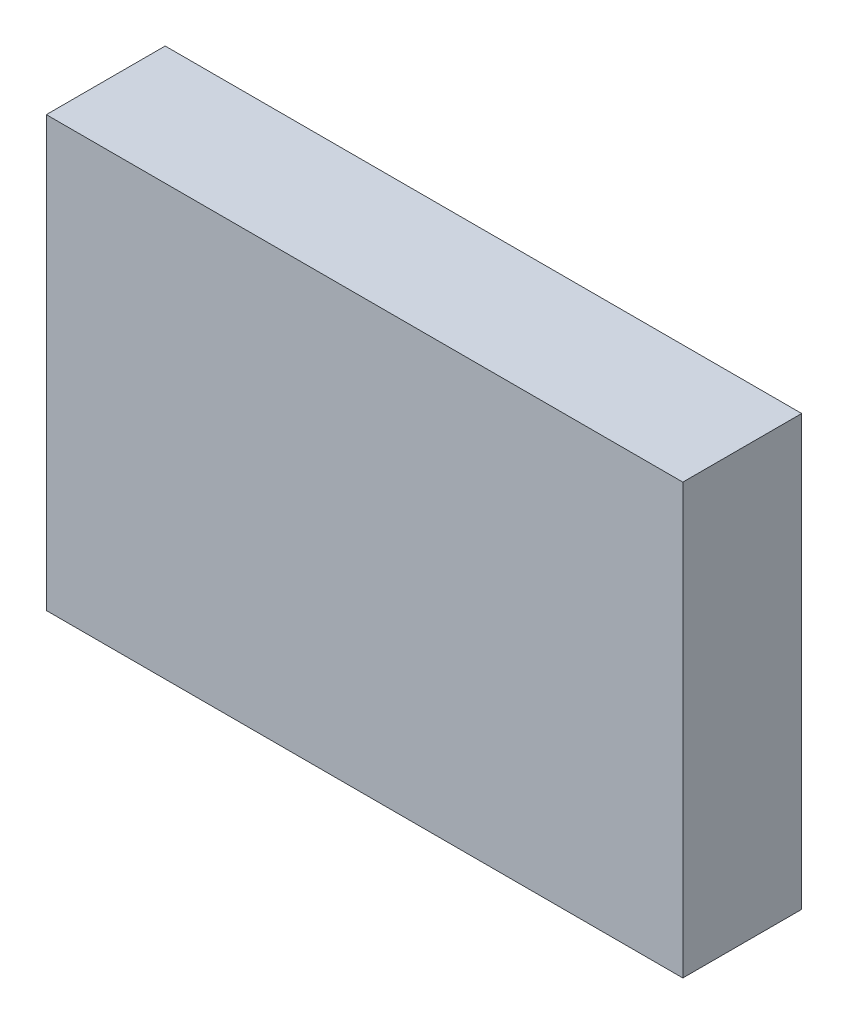
ISO-10303-21;
HEADER;
FILE_DESCRIPTION(('STEP AP214'),'2;1');
FILE_NAME('part.step','',(''),(''),'','','');
FILE_SCHEMA(('AUTOMOTIVE_DESIGN { 1 0 10303 214 1 1 1 1 }'));
ENDSEC;
DATA;
#1=APPLICATION_CONTEXT('core data for automotive mechanical design processes');
#2=APPLICATION_PROTOCOL_DEFINITION('international standard','automotive_design',2000,#1);
#3=PRODUCT_CONTEXT('',#1,'mechanical');
#4=PRODUCT('Part','Part','',(#3));
#5=PRODUCT_RELATED_PRODUCT_CATEGORY('part','',(#4));
#6=PRODUCT_DEFINITION_FORMATION('','',#4);
#7=PRODUCT_DEFINITION_CONTEXT('part definition',#1,'design');
#8=PRODUCT_DEFINITION('design','',#6,#7);
#9=PRODUCT_DEFINITION_SHAPE('','',#8);
#10=(LENGTH_UNIT() NAMED_UNIT(*) SI_UNIT(.MILLI.,.METRE.));
#11=(NAMED_UNIT(*) PLANE_ANGLE_UNIT() SI_UNIT($,.RADIAN.));
#12=(NAMED_UNIT(*) SI_UNIT($,.STERADIAN.) SOLID_ANGLE_UNIT());
#13=UNCERTAINTY_MEASURE_WITH_UNIT(LENGTH_MEASURE(1.E-05),#10,'distance_accuracy_value','');
#14=(GEOMETRIC_REPRESENTATION_CONTEXT(3) GLOBAL_UNCERTAINTY_ASSIGNED_CONTEXT((#13)) GLOBAL_UNIT_ASSIGNED_CONTEXT((#10,
#11,#12)) REPRESENTATION_CONTEXT('',''));
#15=CARTESIAN_POINT('',(0.,0.,0.));
#16=DIRECTION('',(0.,0.,1.));
#17=DIRECTION('',(1.,0.,0.));
#18=AXIS2_PLACEMENT_3D('',#15,#16,#17);
#19=CARTESIAN_POINT('',(4.15000186,2.79999948,1.54999944));
#20=DIRECTION('',(0.,0.,-1.));
#21=DIRECTION('',(-1.,0.,0.));
#22=AXIS2_PLACEMENT_3D('',#19,#20,#21);
#23=PLANE('',#22);
#24=DIRECTION('',(0.,1.,0.));
#25=VECTOR('',#24,1.);
#26=CARTESIAN_POINT('',(-4.14999932,2.79999948,1.54999944));
#27=LINE('',#26,#25);
#28=CARTESIAN_POINT('',(-4.14999932,2.79999948,1.54999944));
#29=VERTEX_POINT('',#28);
#30=CARTESIAN_POINT('',(-4.14999932,-2.79999948,1.54999944));
#31=VERTEX_POINT('',#30);
#32=EDGE_CURVE('E55',#29,#31,#27,.F.);
#33=ORIENTED_EDGE('',*,*,#32,.T.);
#34=DIRECTION('',(1.,0.,0.));
#35=VECTOR('',#34,1.);
#36=CARTESIAN_POINT('',(-4.14999932,-2.79999948,1.54999944));
#37=LINE('',#36,#35);
#38=CARTESIAN_POINT('',(4.15000186,-2.79999948,1.54999944));
#39=VERTEX_POINT('',#38);
#40=EDGE_CURVE('E57',#31,#39,#37,.T.);
#41=ORIENTED_EDGE('',*,*,#40,.T.);
#42=DIRECTION('',(0.,1.,0.));
#43=VECTOR('',#42,1.);
#44=CARTESIAN_POINT('',(4.15000186,-2.79999948,1.54999944));
#45=LINE('',#44,#43);
#46=CARTESIAN_POINT('',(4.15000186,2.79999948,1.54999944));
#47=VERTEX_POINT('',#46);
#48=EDGE_CURVE('E20',#39,#47,#45,.T.);
#49=ORIENTED_EDGE('',*,*,#48,.T.);
#50=DIRECTION('',(1.,0.,0.));
#51=VECTOR('',#50,1.);
#52=CARTESIAN_POINT('',(4.15000186,2.79999948,1.54999944));
#53=LINE('',#52,#51);
#54=EDGE_CURVE('E80',#47,#29,#53,.F.);
#55=ORIENTED_EDGE('',*,*,#54,.T.);
#56=EDGE_LOOP('',(#33,#41,#49,#55));
#57=FACE_BOUND('',#56,.T.);
#58=ADVANCED_FACE('F17',(#57),#23,.F.);
#59=CARTESIAN_POINT('',(4.15000186,-2.79999948,0.));
#60=DIRECTION('',(-1.,0.,0.));
#61=DIRECTION('',(0.,0.,1.));
#62=AXIS2_PLACEMENT_3D('',#59,#60,#61);
#63=PLANE('',#62);
#64=DIRECTION('',(0.,0.,-1.));
#65=VECTOR('',#64,1.);
#66=CARTESIAN_POINT('',(4.15000186,2.79999948,0.));
#67=LINE('',#66,#65);
#68=CARTESIAN_POINT('',(4.15000186,2.79999948,0.));
#69=VERTEX_POINT('',#68);
#70=EDGE_CURVE('E68',#69,#47,#67,.F.);
#71=ORIENTED_EDGE('',*,*,#70,.T.);
#72=ORIENTED_EDGE('',*,*,#48,.F.);
#73=DIRECTION('',(0.,0.,1.));
#74=VECTOR('',#73,1.);
#75=CARTESIAN_POINT('',(4.15000186,-2.79999948,0.));
#76=LINE('',#75,#74);
#77=CARTESIAN_POINT('',(4.15000186,-2.79999948,0.));
#78=VERTEX_POINT('',#77);
#79=EDGE_CURVE('E63',#39,#78,#76,.F.);
#80=ORIENTED_EDGE('',*,*,#79,.T.);
#81=DIRECTION('',(0.,1.,0.));
#82=VECTOR('',#81,1.);
#83=CARTESIAN_POINT('',(4.15000186,2.79999948,0.));
#84=LINE('',#83,#82);
#85=EDGE_CURVE('E83',#69,#78,#84,.F.);
#86=ORIENTED_EDGE('',*,*,#85,.F.);
#87=EDGE_LOOP('',(#71,#72,#80,#86));
#88=FACE_BOUND('',#87,.T.);
#89=ADVANCED_FACE('F65',(#88),#63,.F.);
#90=CARTESIAN_POINT('',(-4.14999932,-2.79999948,0.));
#91=DIRECTION('',(0.,1.,0.));
#92=DIRECTION('',(0.,0.,1.));
#93=AXIS2_PLACEMENT_3D('',#90,#91,#92);
#94=PLANE('',#93);
#95=ORIENTED_EDGE('',*,*,#79,.F.);
#96=ORIENTED_EDGE('',*,*,#40,.F.);
#97=DIRECTION('',(0.,0.,-1.));
#98=VECTOR('',#97,1.);
#99=CARTESIAN_POINT('',(-4.14999932,-2.79999948,0.));
#100=LINE('',#99,#98);
#101=CARTESIAN_POINT('',(-4.14999932,-2.79999948,0.));
#102=VERTEX_POINT('',#101);
#103=EDGE_CURVE('E75',#31,#102,#100,.T.);
#104=ORIENTED_EDGE('',*,*,#103,.T.);
#105=DIRECTION('',(-1.,0.,0.));
#106=VECTOR('',#105,1.);
#107=CARTESIAN_POINT('',(4.15000186,-2.79999948,0.));
#108=LINE('',#107,#106);
#109=EDGE_CURVE('E72',#78,#102,#108,.T.);
#110=ORIENTED_EDGE('',*,*,#109,.F.);
#111=EDGE_LOOP('',(#95,#96,#104,#110));
#112=FACE_BOUND('',#111,.T.);
#113=ADVANCED_FACE('F70',(#112),#94,.F.);
#114=CARTESIAN_POINT('',(-4.14999932,2.79999948,0.));
#115=DIRECTION('',(1.,0.,0.));
#116=DIRECTION('',(0.,0.,-1.));
#117=AXIS2_PLACEMENT_3D('',#114,#115,#116);
#118=PLANE('',#117);
#119=ORIENTED_EDGE('',*,*,#103,.F.);
#120=ORIENTED_EDGE('',*,*,#32,.F.);
#121=DIRECTION('',(0.,0.,-1.));
#122=VECTOR('',#121,1.);
#123=CARTESIAN_POINT('',(-4.14999932,2.79999948,0.));
#124=LINE('',#123,#122);
#125=CARTESIAN_POINT('',(-4.14999932,2.79999948,0.));
#126=VERTEX_POINT('',#125);
#127=EDGE_CURVE('E35',#29,#126,#124,.T.);
#128=ORIENTED_EDGE('',*,*,#127,.T.);
#129=DIRECTION('',(0.,1.,0.));
#130=VECTOR('',#129,1.);
#131=CARTESIAN_POINT('',(-4.14999932,2.79999948,0.));
#132=LINE('',#131,#130);
#133=EDGE_CURVE('E26',#102,#126,#132,.T.);
#134=ORIENTED_EDGE('',*,*,#133,.F.);
#135=EDGE_LOOP('',(#119,#120,#128,#134));
#136=FACE_BOUND('',#135,.T.);
#137=ADVANCED_FACE('F89',(#136),#118,.F.);
#138=CARTESIAN_POINT('',(4.15000186,2.79999948,0.));
#139=DIRECTION('',(0.,-1.,0.));
#140=DIRECTION('',(0.,0.,-1.));
#141=AXIS2_PLACEMENT_3D('',#138,#139,#140);
#142=PLANE('',#141);
#143=ORIENTED_EDGE('',*,*,#127,.F.);
#144=ORIENTED_EDGE('',*,*,#54,.F.);
#145=ORIENTED_EDGE('',*,*,#70,.F.);
#146=DIRECTION('',(-1.,0.,0.));
#147=VECTOR('',#146,1.);
#148=CARTESIAN_POINT('',(4.15000186,2.79999948,0.));
#149=LINE('',#148,#147);
#150=EDGE_CURVE('E11',#126,#69,#149,.F.);
#151=ORIENTED_EDGE('',*,*,#150,.F.);
#152=EDGE_LOOP('',(#143,#144,#145,#151));
#153=FACE_BOUND('',#152,.T.);
#154=ADVANCED_FACE('F91',(#153),#142,.F.);
#155=CARTESIAN_POINT('',(4.15000186,2.79999948,0.));
#156=DIRECTION('',(0.,0.,-1.));
#157=DIRECTION('',(-1.,0.,0.));
#158=AXIS2_PLACEMENT_3D('',#155,#156,#157);
#159=PLANE('',#158);
#160=ORIENTED_EDGE('',*,*,#133,.T.);
#161=ORIENTED_EDGE('',*,*,#150,.T.);
#162=ORIENTED_EDGE('',*,*,#85,.T.);
#163=ORIENTED_EDGE('',*,*,#109,.T.);
#164=EDGE_LOOP('',(#160,#161,#162,#163));
#165=FACE_BOUND('',#164,.T.);
#166=ADVANCED_FACE('F88',(#165),#159,.T.);
#167=CLOSED_SHELL('',(#58,#89,#113,#137,#154,#166));
#168=MANIFOLD_SOLID_BREP('B1',#167);
#169=ADVANCED_BREP_SHAPE_REPRESENTATION('',(#18,#168),#14);
#170=SHAPE_DEFINITION_REPRESENTATION(#9,#169);
ENDSEC;
END-ISO-10303-21;
